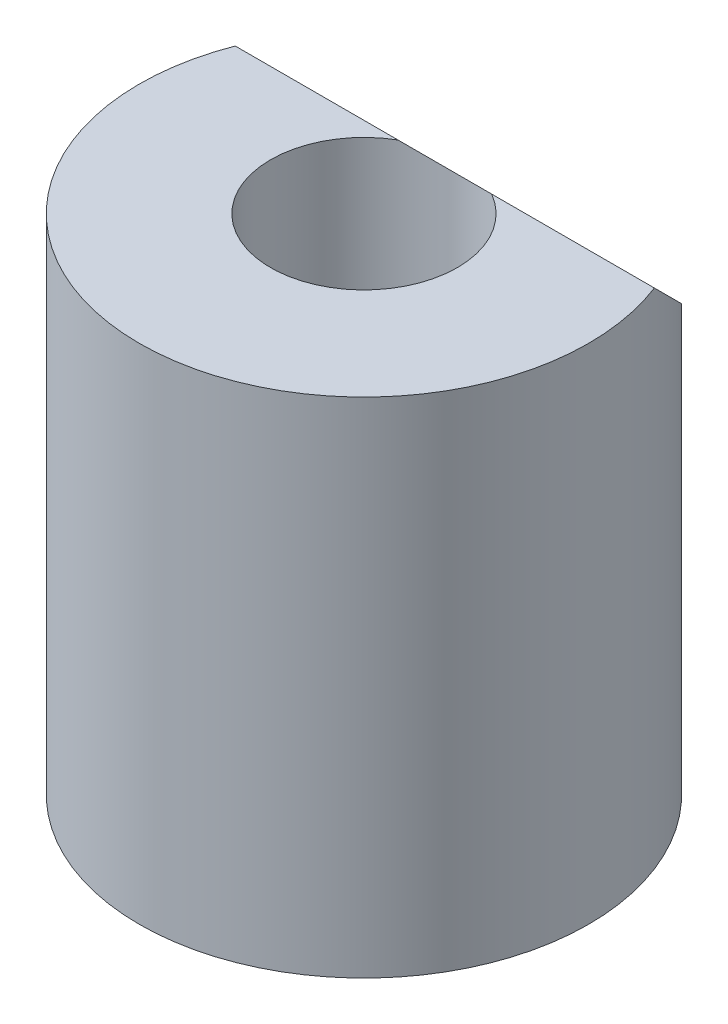
ISO-10303-21;
HEADER;
FILE_DESCRIPTION(('STEP AP214'),'2;1');
FILE_NAME('part.step','',(''),(''),'','','');
FILE_SCHEMA(('AUTOMOTIVE_DESIGN { 1 0 10303 214 1 1 1 1 }'));
ENDSEC;
DATA;
#1=APPLICATION_CONTEXT('core data for automotive mechanical design processes');
#2=APPLICATION_PROTOCOL_DEFINITION('international standard','automotive_design',2000,#1);
#3=PRODUCT_CONTEXT('',#1,'mechanical');
#4=PRODUCT('Part','Part','',(#3));
#5=PRODUCT_RELATED_PRODUCT_CATEGORY('part','',(#4));
#6=PRODUCT_DEFINITION_FORMATION('','',#4);
#7=PRODUCT_DEFINITION_CONTEXT('part definition',#1,'design');
#8=PRODUCT_DEFINITION('design','',#6,#7);
#9=PRODUCT_DEFINITION_SHAPE('','',#8);
#10=(LENGTH_UNIT() NAMED_UNIT(*) SI_UNIT(.MILLI.,.METRE.));
#11=(NAMED_UNIT(*) PLANE_ANGLE_UNIT() SI_UNIT($,.RADIAN.));
#12=(NAMED_UNIT(*) SI_UNIT($,.STERADIAN.) SOLID_ANGLE_UNIT());
#13=UNCERTAINTY_MEASURE_WITH_UNIT(LENGTH_MEASURE(1.E-05),#10,'distance_accuracy_value','');
#14=(GEOMETRIC_REPRESENTATION_CONTEXT(3) GLOBAL_UNCERTAINTY_ASSIGNED_CONTEXT((#13)) GLOBAL_UNIT_ASSIGNED_CONTEXT((#10,
#11,#12)) REPRESENTATION_CONTEXT('',''));
#15=CARTESIAN_POINT('',(0.,0.,0.));
#16=DIRECTION('',(0.,0.,1.));
#17=DIRECTION('',(1.,0.,0.));
#18=AXIS2_PLACEMENT_3D('',#15,#16,#17);
#19=CARTESIAN_POINT('',(0.,-7.3539105243401,0.));
#20=DIRECTION('',(0.,1.,0.));
#21=DIRECTION('',(0.,0.,1.));
#22=AXIS2_PLACEMENT_3D('',#19,#20,#21);
#23=CYLINDRICAL_SURFACE('',#22,2.6);
#24=CARTESIAN_POINT('',(0.,14.,0.));
#25=DIRECTION('',(0.,1.,0.));
#26=DIRECTION('',(0.,0.,1.));
#27=AXIS2_PLACEMENT_3D('',#24,#25,#26);
#28=CIRCLE('',#27,2.6);
#29=CARTESIAN_POINT('',(-1.30288142207954,14.,-2.25));
#30=VERTEX_POINT('',#29);
#31=CARTESIAN_POINT('',(1.30288142207954,14.,-2.25));
#32=VERTEX_POINT('',#31);
#33=EDGE_CURVE('E63',#30,#32,#28,.T.);
#34=ORIENTED_EDGE('',*,*,#33,.T.);
#35=CARTESIAN_POINT('',(0.,16.25,0.));
#36=DIRECTION('',(0.,-0.707106781186551,0.707106781186544));
#37=DIRECTION('',(0.,0.707106781186544,0.707106781186551));
#38=AXIS2_PLACEMENT_3D('',#35,#36,#37);
#39=ELLIPSE('',#38,3.67695526217003,2.6);
#40=EDGE_CURVE('E11',#32,#30,#39,.F.);
#41=ORIENTED_EDGE('',*,*,#40,.T.);
#42=EDGE_LOOP('',(#34,#41));
#43=FACE_BOUND('',#42,.T.);
#44=CARTESIAN_POINT('',(0.,4.,0.));
#45=DIRECTION('',(0.,-1.,0.));
#46=DIRECTION('',(0.,0.,-1.));
#47=AXIS2_PLACEMENT_3D('',#44,#45,#46);
#48=CIRCLE('',#47,2.6);
#49=CARTESIAN_POINT('',(0.,4.,-2.6));
#50=VERTEX_POINT('',#49);
#51=EDGE_CURVE('E37',#50,#50,#48,.F.);
#52=ORIENTED_EDGE('',*,*,#51,.F.);
#53=EDGE_LOOP('',(#52));
#54=FACE_BOUND('',#53,.T.);
#55=ADVANCED_FACE('F33',(#43,#54),#23,.F.);
#56=CARTESIAN_POINT('',(0.,14.,0.));
#57=DIRECTION('',(0.,-1.,0.));
#58=DIRECTION('',(0.,0.,-1.));
#59=AXIS2_PLACEMENT_3D('',#56,#57,#58);
#60=CYLINDRICAL_SURFACE('',#59,6.25);
#61=CARTESIAN_POINT('',(0.,16.25,0.));
#62=DIRECTION('',(0.,-0.707106781186551,0.707106781186544));
#63=DIRECTION('',(0.,-0.707106781186544,-0.707106781186551));
#64=AXIS2_PLACEMENT_3D('',#61,#62,#63);
#65=ELLIPSE('',#64,8.8388347648318,6.25);
#66=CARTESIAN_POINT('',(-5.8309518948453,14.,-2.25));
#67=VERTEX_POINT('',#66);
#68=CARTESIAN_POINT('',(5.8309518948453,14.,-2.25));
#69=VERTEX_POINT('',#68);
#70=EDGE_CURVE('E54',#67,#69,#65,.T.);
#71=ORIENTED_EDGE('',*,*,#70,.T.);
#72=CARTESIAN_POINT('',(0.,14.,0.));
#73=DIRECTION('',(0.,1.,0.));
#74=DIRECTION('',(0.,0.,1.));
#75=AXIS2_PLACEMENT_3D('',#72,#73,#74);
#76=CIRCLE('',#75,6.25);
#77=EDGE_CURVE('E42',#67,#69,#76,.T.);
#78=ORIENTED_EDGE('',*,*,#77,.F.);
#79=EDGE_LOOP('',(#71,#78));
#80=FACE_BOUND('',#79,.T.);
#81=CARTESIAN_POINT('',(0.,0.,0.));
#82=DIRECTION('',(0.,1.,0.));
#83=DIRECTION('',(0.,0.,1.));
#84=AXIS2_PLACEMENT_3D('',#81,#82,#83);
#85=CIRCLE('',#84,6.25);
#86=CARTESIAN_POINT('',(0.,0.,6.25));
#87=VERTEX_POINT('',#86);
#88=EDGE_CURVE('E71',#87,#87,#85,.T.);
#89=ORIENTED_EDGE('',*,*,#88,.T.);
#90=EDGE_LOOP('',(#89));
#91=FACE_BOUND('',#90,.T.);
#92=ADVANCED_FACE('F35',(#80,#91),#60,.T.);
#93=CARTESIAN_POINT('',(0.,14.,0.));
#94=DIRECTION('',(0.,1.,0.));
#95=DIRECTION('',(0.,0.,1.));
#96=AXIS2_PLACEMENT_3D('',#93,#94,#95);
#97=PLANE('',#96);
#98=DIRECTION('',(1.,0.,0.));
#99=VECTOR('',#98,1.);
#100=CARTESIAN_POINT('',(-7.,14.,-2.25));
#101=LINE('',#100,#99);
#102=EDGE_CURVE('E49',#67,#30,#101,.T.);
#103=ORIENTED_EDGE('',*,*,#102,.F.);
#104=ORIENTED_EDGE('',*,*,#77,.T.);
#105=EDGE_CURVE('E61',#32,#69,#101,.T.);
#106=ORIENTED_EDGE('',*,*,#105,.F.);
#107=ORIENTED_EDGE('',*,*,#33,.F.);
#108=EDGE_LOOP('',(#103,#104,#106,#107));
#109=FACE_BOUND('',#108,.T.);
#110=ADVANCED_FACE('F67',(#109),#97,.T.);
#111=CARTESIAN_POINT('',(0.,0.,0.));
#112=DIRECTION('',(0.,1.,0.));
#113=DIRECTION('',(0.,0.,1.));
#114=AXIS2_PLACEMENT_3D('',#111,#112,#113);
#115=PLANE('',#114);
#116=CARTESIAN_POINT('',(0.,0.,0.));
#117=DIRECTION('',(0.,-1.,0.));
#118=DIRECTION('',(0.,0.,-1.));
#119=AXIS2_PLACEMENT_3D('',#116,#117,#118);
#120=CIRCLE('',#119,4.5);
#121=CARTESIAN_POINT('',(0.,0.,-4.5));
#122=VERTEX_POINT('',#121);
#123=EDGE_CURVE('E77',#122,#122,#120,.T.);
#124=ORIENTED_EDGE('',*,*,#123,.F.);
#125=EDGE_LOOP('',(#124));
#126=FACE_BOUND('',#125,.T.);
#127=ORIENTED_EDGE('',*,*,#88,.F.);
#128=EDGE_LOOP('',(#127));
#129=FACE_BOUND('',#128,.T.);
#130=ADVANCED_FACE('F99',(#126,#129),#115,.F.);
#131=CARTESIAN_POINT('',(-7.,14.,-2.25));
#132=DIRECTION('',(0.,-0.707106781186551,0.707106781186544));
#133=DIRECTION('',(0.,-0.707106781186544,-0.707106781186551));
#134=AXIS2_PLACEMENT_3D('',#131,#132,#133);
#135=PLANE('',#134);
#136=ORIENTED_EDGE('',*,*,#70,.F.);
#137=ORIENTED_EDGE('',*,*,#102,.T.);
#138=ORIENTED_EDGE('',*,*,#40,.F.);
#139=ORIENTED_EDGE('',*,*,#105,.T.);
#140=EDGE_LOOP('',(#136,#137,#138,#139));
#141=FACE_BOUND('',#140,.T.);
#142=ADVANCED_FACE('F59',(#141),#135,.F.);
#143=CARTESIAN_POINT('',(0.,4.,0.));
#144=DIRECTION('',(0.,-1.,0.));
#145=DIRECTION('',(0.,0.,-1.));
#146=AXIS2_PLACEMENT_3D('',#143,#144,#145);
#147=PLANE('',#146);
#148=CARTESIAN_POINT('',(0.,4.,0.));
#149=DIRECTION('',(0.,-1.,0.));
#150=DIRECTION('',(0.,0.,-1.));
#151=AXIS2_PLACEMENT_3D('',#148,#149,#150);
#152=CIRCLE('',#151,4.5);
#153=CARTESIAN_POINT('',(0.,4.,-4.5));
#154=VERTEX_POINT('',#153);
#155=EDGE_CURVE('E80',#154,#154,#152,.T.);
#156=ORIENTED_EDGE('',*,*,#155,.T.);
#157=EDGE_LOOP('',(#156));
#158=FACE_BOUND('',#157,.T.);
#159=ORIENTED_EDGE('',*,*,#51,.T.);
#160=EDGE_LOOP('',(#159));
#161=FACE_BOUND('',#160,.T.);
#162=ADVANCED_FACE('F87',(#158,#161),#147,.T.);
#163=CARTESIAN_POINT('',(0.,4.,0.));
#164=DIRECTION('',(0.,-1.,0.));
#165=DIRECTION('',(0.,0.,-1.));
#166=AXIS2_PLACEMENT_3D('',#163,#164,#165);
#167=CYLINDRICAL_SURFACE('',#166,4.5);
#168=ORIENTED_EDGE('',*,*,#155,.F.);
#169=EDGE_LOOP('',(#168));
#170=FACE_BOUND('',#169,.T.);
#171=ORIENTED_EDGE('',*,*,#123,.T.);
#172=EDGE_LOOP('',(#171));
#173=FACE_BOUND('',#172,.T.);
#174=ADVANCED_FACE('F109',(#170,#173),#167,.F.);
#175=CLOSED_SHELL('',(#55,#92,#110,#130,#142,#162,#174));
#176=MANIFOLD_SOLID_BREP('B2',#175);
#177=ADVANCED_BREP_SHAPE_REPRESENTATION('',(#18,#176),#14);
#178=SHAPE_DEFINITION_REPRESENTATION(#9,#177);
ENDSEC;
END-ISO-10303-21;
